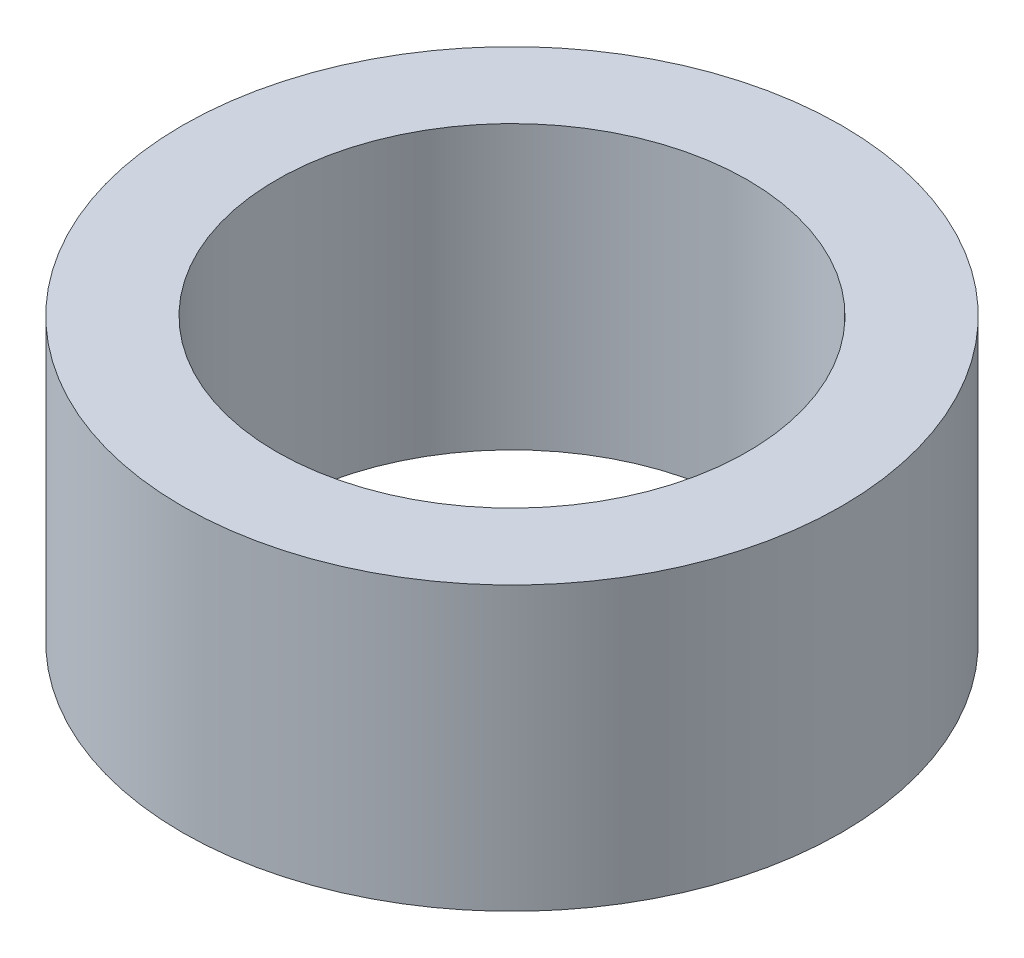
ISO-10303-21;
HEADER;
FILE_DESCRIPTION(('STEP AP214'),'2;1');
FILE_NAME('part.step','',(''),(''),'','','');
FILE_SCHEMA(('AUTOMOTIVE_DESIGN { 1 0 10303 214 1 1 1 1 }'));
ENDSEC;
DATA;
#1=APPLICATION_CONTEXT('core data for automotive mechanical design processes');
#2=APPLICATION_PROTOCOL_DEFINITION('international standard','automotive_design',2000,#1);
#3=PRODUCT_CONTEXT('',#1,'mechanical');
#4=PRODUCT('Part','Part','',(#3));
#5=PRODUCT_RELATED_PRODUCT_CATEGORY('part','',(#4));
#6=PRODUCT_DEFINITION_FORMATION('','',#4);
#7=PRODUCT_DEFINITION_CONTEXT('part definition',#1,'design');
#8=PRODUCT_DEFINITION('design','',#6,#7);
#9=PRODUCT_DEFINITION_SHAPE('','',#8);
#10=(LENGTH_UNIT() NAMED_UNIT(*) SI_UNIT(.MILLI.,.METRE.));
#11=(NAMED_UNIT(*) PLANE_ANGLE_UNIT() SI_UNIT($,.RADIAN.));
#12=(NAMED_UNIT(*) SI_UNIT($,.STERADIAN.) SOLID_ANGLE_UNIT());
#13=UNCERTAINTY_MEASURE_WITH_UNIT(LENGTH_MEASURE(1.E-05),#10,'distance_accuracy_value','');
#14=(GEOMETRIC_REPRESENTATION_CONTEXT(3) GLOBAL_UNCERTAINTY_ASSIGNED_CONTEXT((#13)) GLOBAL_UNIT_ASSIGNED_CONTEXT((#10,
#11,#12)) REPRESENTATION_CONTEXT('',''));
#15=CARTESIAN_POINT('',(0.,0.,0.));
#16=DIRECTION('',(0.,0.,1.));
#17=DIRECTION('',(1.,0.,0.));
#18=AXIS2_PLACEMENT_3D('',#15,#16,#17);
#19=CARTESIAN_POINT('',(0.,15.,0.));
#20=DIRECTION('',(0.,1.,0.));
#21=DIRECTION('',(0.,0.,1.));
#22=AXIS2_PLACEMENT_3D('',#19,#20,#21);
#23=PLANE('',#22);
#24=CARTESIAN_POINT('',(0.,15.,0.));
#25=DIRECTION('',(0.,1.,0.));
#26=DIRECTION('',(0.,0.,1.));
#27=AXIS2_PLACEMENT_3D('',#24,#25,#26);
#28=CIRCLE('',#27,17.5);
#29=CARTESIAN_POINT('',(0.,15.,17.5));
#30=VERTEX_POINT('',#29);
#31=EDGE_CURVE('E10',#30,#30,#28,.T.);
#32=ORIENTED_EDGE('',*,*,#31,.T.);
#33=EDGE_LOOP('',(#32));
#34=FACE_BOUND('',#33,.T.);
#35=CARTESIAN_POINT('',(0.,15.,0.));
#36=DIRECTION('',(0.,1.,0.));
#37=DIRECTION('',(0.,0.,1.));
#38=AXIS2_PLACEMENT_3D('',#35,#36,#37);
#39=CIRCLE('',#38,12.5);
#40=CARTESIAN_POINT('',(0.,15.,12.5));
#41=VERTEX_POINT('',#40);
#42=EDGE_CURVE('E50',#41,#41,#39,.T.);
#43=ORIENTED_EDGE('',*,*,#42,.F.);
#44=EDGE_LOOP('',(#43));
#45=FACE_BOUND('',#44,.T.);
#46=ADVANCED_FACE('F37',(#34,#45),#23,.T.);
#47=CARTESIAN_POINT('',(0.,0.,0.));
#48=DIRECTION('',(0.,1.,0.));
#49=DIRECTION('',(0.,0.,1.));
#50=AXIS2_PLACEMENT_3D('',#47,#48,#49);
#51=PLANE('',#50);
#52=CARTESIAN_POINT('',(0.,0.,0.));
#53=DIRECTION('',(0.,1.,0.));
#54=DIRECTION('',(0.,0.,1.));
#55=AXIS2_PLACEMENT_3D('',#52,#53,#54);
#56=CIRCLE('',#55,17.5);
#57=CARTESIAN_POINT('',(0.,0.,17.5));
#58=VERTEX_POINT('',#57);
#59=EDGE_CURVE('E41',#58,#58,#56,.T.);
#60=ORIENTED_EDGE('',*,*,#59,.F.);
#61=EDGE_LOOP('',(#60));
#62=FACE_BOUND('',#61,.T.);
#63=CARTESIAN_POINT('',(0.,0.,0.));
#64=DIRECTION('',(0.,1.,0.));
#65=DIRECTION('',(0.,0.,1.));
#66=AXIS2_PLACEMENT_3D('',#63,#64,#65);
#67=CIRCLE('',#66,12.5);
#68=CARTESIAN_POINT('',(0.,0.,12.5));
#69=VERTEX_POINT('',#68);
#70=EDGE_CURVE('E52',#69,#69,#67,.T.);
#71=ORIENTED_EDGE('',*,*,#70,.T.);
#72=EDGE_LOOP('',(#71));
#73=FACE_BOUND('',#72,.T.);
#74=ADVANCED_FACE('F64',(#62,#73),#51,.F.);
#75=CARTESIAN_POINT('',(0.,15.,0.));
#76=DIRECTION('',(0.,-1.,0.));
#77=DIRECTION('',(0.,0.,-1.));
#78=AXIS2_PLACEMENT_3D('',#75,#76,#77);
#79=CYLINDRICAL_SURFACE('',#78,17.5);
#80=ORIENTED_EDGE('',*,*,#31,.F.);
#81=EDGE_LOOP('',(#80));
#82=FACE_BOUND('',#81,.T.);
#83=ORIENTED_EDGE('',*,*,#59,.T.);
#84=EDGE_LOOP('',(#83));
#85=FACE_BOUND('',#84,.T.);
#86=ADVANCED_FACE('F39',(#82,#85),#79,.T.);
#87=CARTESIAN_POINT('',(0.,15.,0.));
#88=DIRECTION('',(0.,-1.,0.));
#89=DIRECTION('',(0.,0.,-1.));
#90=AXIS2_PLACEMENT_3D('',#87,#88,#89);
#91=CYLINDRICAL_SURFACE('',#90,12.5);
#92=ORIENTED_EDGE('',*,*,#42,.T.);
#93=EDGE_LOOP('',(#92));
#94=FACE_BOUND('',#93,.T.);
#95=ORIENTED_EDGE('',*,*,#70,.F.);
#96=EDGE_LOOP('',(#95));
#97=FACE_BOUND('',#96,.T.);
#98=ADVANCED_FACE('F60',(#94,#97),#91,.F.);
#99=CLOSED_SHELL('',(#46,#74,#86,#98));
#100=MANIFOLD_SOLID_BREP('B2',#99);
#101=ADVANCED_BREP_SHAPE_REPRESENTATION('',(#18,#100),#14);
#102=SHAPE_DEFINITION_REPRESENTATION(#9,#101);
ENDSEC;
END-ISO-10303-21;
